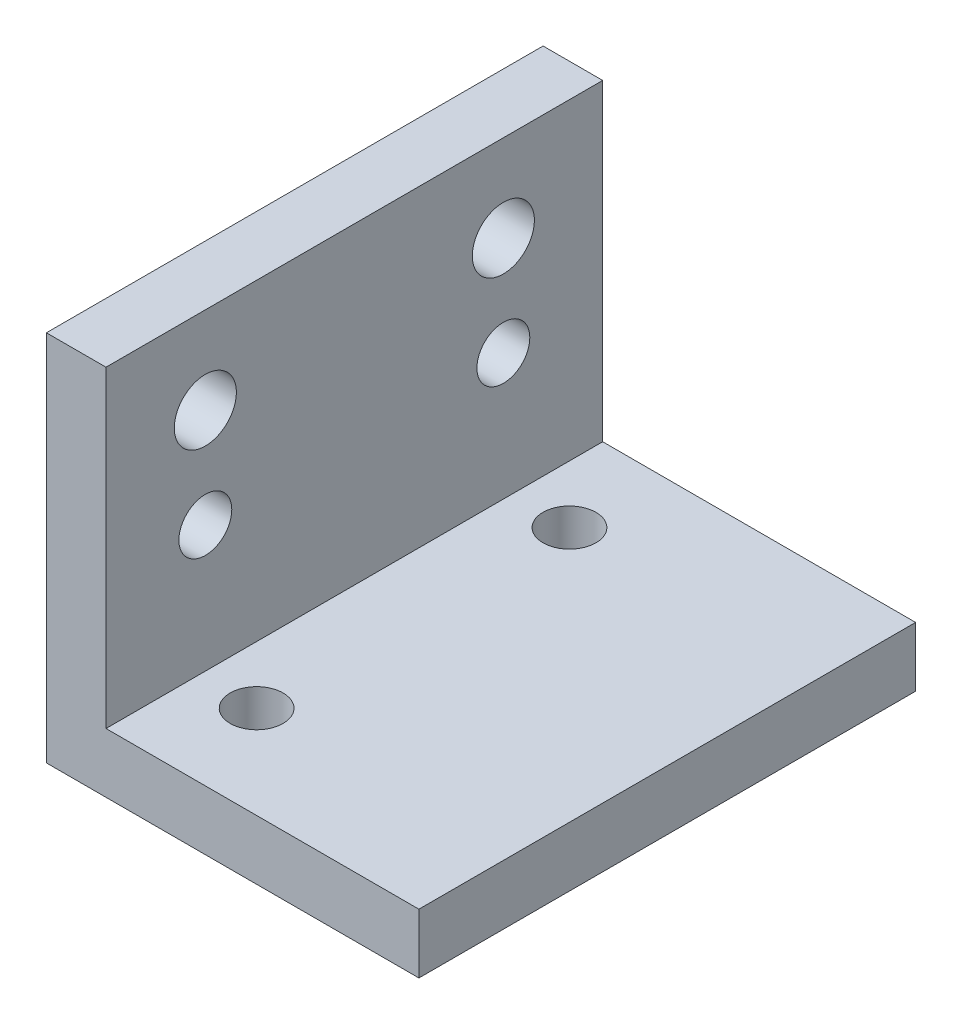
ISO-10303-21;
HEADER;
FILE_DESCRIPTION(('STEP AP214'),'2;1');
FILE_NAME('part.step','',(''),(''),'','','');
FILE_SCHEMA(('AUTOMOTIVE_DESIGN { 1 0 10303 214 1 1 1 1 }'));
ENDSEC;
DATA;
#1=APPLICATION_CONTEXT('core data for automotive mechanical design processes');
#2=APPLICATION_PROTOCOL_DEFINITION('international standard','automotive_design',2000,#1);
#3=PRODUCT_CONTEXT('',#1,'mechanical');
#4=PRODUCT('Part','Part','',(#3));
#5=PRODUCT_RELATED_PRODUCT_CATEGORY('part','',(#4));
#6=PRODUCT_DEFINITION_FORMATION('','',#4);
#7=PRODUCT_DEFINITION_CONTEXT('part definition',#1,'design');
#8=PRODUCT_DEFINITION('design','',#6,#7);
#9=PRODUCT_DEFINITION_SHAPE('','',#8);
#10=(LENGTH_UNIT() NAMED_UNIT(*) SI_UNIT(.MILLI.,.METRE.));
#11=(NAMED_UNIT(*) PLANE_ANGLE_UNIT() SI_UNIT($,.RADIAN.));
#12=(NAMED_UNIT(*) SI_UNIT($,.STERADIAN.) SOLID_ANGLE_UNIT());
#13=UNCERTAINTY_MEASURE_WITH_UNIT(LENGTH_MEASURE(1.E-05),#10,'distance_accuracy_value','');
#14=(GEOMETRIC_REPRESENTATION_CONTEXT(3) GLOBAL_UNCERTAINTY_ASSIGNED_CONTEXT((#13)) GLOBAL_UNIT_ASSIGNED_CONTEXT((#10,
#11,#12)) REPRESENTATION_CONTEXT('',''));
#15=CARTESIAN_POINT('',(0.,0.,0.));
#16=DIRECTION('',(0.,0.,1.));
#17=DIRECTION('',(1.,0.,0.));
#18=AXIS2_PLACEMENT_3D('',#15,#16,#17);
#19=CARTESIAN_POINT('',(0.,0.,25.4));
#20=DIRECTION('',(1.,0.,0.));
#21=DIRECTION('',(0.,0.,-1.));
#22=AXIS2_PLACEMENT_3D('',#19,#20,#21);
#23=PLANE('',#22);
#24=CARTESIAN_POINT('',(0.,14.605,5.07999999999999));
#25=DIRECTION('',(1.,0.,0.));
#26=DIRECTION('',(0.,1.,0.));
#27=AXIS2_PLACEMENT_3D('',#24,#25,#26);
#28=CIRCLE('',#27,1.5875);
#29=CARTESIAN_POINT('',(0.,16.1925,5.07999999999999));
#30=VERTEX_POINT('',#29);
#31=EDGE_CURVE('E178',#30,#30,#28,.T.);
#32=ORIENTED_EDGE('',*,*,#31,.T.);
#33=EDGE_LOOP('',(#32));
#34=FACE_BOUND('',#33,.T.);
#35=CARTESIAN_POINT('',(0.,14.605,20.32));
#36=DIRECTION('',(1.,0.,0.));
#37=DIRECTION('',(0.,1.,0.));
#38=AXIS2_PLACEMENT_3D('',#35,#36,#37);
#39=CIRCLE('',#38,1.5875);
#40=CARTESIAN_POINT('',(0.,16.1925,20.32));
#41=VERTEX_POINT('',#40);
#42=EDGE_CURVE('E182',#41,#41,#39,.T.);
#43=ORIENTED_EDGE('',*,*,#42,.T.);
#44=EDGE_LOOP('',(#43));
#45=FACE_BOUND('',#44,.T.);
#46=CARTESIAN_POINT('',(0.,9.525,20.32));
#47=DIRECTION('',(1.,0.,0.));
#48=DIRECTION('',(0.,0.,-1.));
#49=AXIS2_PLACEMENT_3D('',#46,#47,#48);
#50=CIRCLE('',#49,1.35255);
#51=CARTESIAN_POINT('',(0.,9.525,18.96745));
#52=VERTEX_POINT('',#51);
#53=EDGE_CURVE('E186',#52,#52,#50,.T.);
#54=ORIENTED_EDGE('',*,*,#53,.T.);
#55=EDGE_LOOP('',(#54));
#56=FACE_BOUND('',#55,.T.);
#57=CARTESIAN_POINT('',(0.,9.525,5.08));
#58=DIRECTION('',(1.,0.,0.));
#59=DIRECTION('',(0.,0.,-1.));
#60=AXIS2_PLACEMENT_3D('',#57,#58,#59);
#61=CIRCLE('',#60,1.35255);
#62=CARTESIAN_POINT('',(0.,9.525,3.72745));
#63=VERTEX_POINT('',#62);
#64=EDGE_CURVE('E135',#63,#63,#61,.T.);
#65=ORIENTED_EDGE('',*,*,#64,.T.);
#66=EDGE_LOOP('',(#65));
#67=FACE_BOUND('',#66,.T.);
#68=DIRECTION('',(0.,-1.,0.));
#69=VECTOR('',#68,1.);
#70=CARTESIAN_POINT('',(0.,0.,0.));
#71=LINE('',#70,#69);
#72=CARTESIAN_POINT('',(0.,19.05,0.));
#73=VERTEX_POINT('',#72);
#74=CARTESIAN_POINT('',(0.,0.,0.));
#75=VERTEX_POINT('',#74);
#76=EDGE_CURVE('E131',#73,#75,#71,.T.);
#77=ORIENTED_EDGE('',*,*,#76,.T.);
#78=DIRECTION('',(0.,0.,-1.));
#79=VECTOR('',#78,1.);
#80=CARTESIAN_POINT('',(0.,0.,25.4));
#81=LINE('',#80,#79);
#82=CARTESIAN_POINT('',(0.,0.,25.4));
#83=VERTEX_POINT('',#82);
#84=EDGE_CURVE('E13',#83,#75,#81,.T.);
#85=ORIENTED_EDGE('',*,*,#84,.F.);
#86=DIRECTION('',(0.,-1.,0.));
#87=VECTOR('',#86,1.);
#88=CARTESIAN_POINT('',(0.,0.,25.4));
#89=LINE('',#88,#87);
#90=CARTESIAN_POINT('',(0.,19.05,25.4));
#91=VERTEX_POINT('',#90);
#92=EDGE_CURVE('E142',#91,#83,#89,.T.);
#93=ORIENTED_EDGE('',*,*,#92,.F.);
#94=DIRECTION('',(0.,0.,-1.));
#95=VECTOR('',#94,1.);
#96=CARTESIAN_POINT('',(0.,19.05,25.4));
#97=LINE('',#96,#95);
#98=EDGE_CURVE('E127',#91,#73,#97,.T.);
#99=ORIENTED_EDGE('',*,*,#98,.T.);
#100=EDGE_LOOP('',(#77,#85,#93,#99));
#101=FACE_BOUND('',#100,.T.);
#102=ADVANCED_FACE('F47',(#34,#45,#56,#67,#101),#23,.F.);
#103=CARTESIAN_POINT('',(0.,0.,25.4));
#104=DIRECTION('',(0.,1.,0.));
#105=DIRECTION('',(0.,0.,1.));
#106=AXIS2_PLACEMENT_3D('',#103,#104,#105);
#107=PLANE('',#106);
#108=CARTESIAN_POINT('',(6.00000000000003,0.,20.65));
#109=DIRECTION('',(0.,1.,0.));
#110=DIRECTION('',(0.,0.,1.));
#111=AXIS2_PLACEMENT_3D('',#108,#109,#110);
#112=CIRCLE('',#111,1.35255);
#113=CARTESIAN_POINT('',(6.00000000000003,0.,22.00255));
#114=VERTEX_POINT('',#113);
#115=EDGE_CURVE('E207',#114,#114,#112,.T.);
#116=ORIENTED_EDGE('',*,*,#115,.T.);
#117=EDGE_LOOP('',(#116));
#118=FACE_BOUND('',#117,.T.);
#119=CARTESIAN_POINT('',(6.00000000000003,0.,4.65000000000003));
#120=DIRECTION('',(0.,1.,0.));
#121=DIRECTION('',(0.,0.,1.));
#122=AXIS2_PLACEMENT_3D('',#119,#120,#121);
#123=CIRCLE('',#122,1.35255);
#124=CARTESIAN_POINT('',(6.00000000000003,0.,6.00255000000003));
#125=VERTEX_POINT('',#124);
#126=EDGE_CURVE('E201',#125,#125,#123,.T.);
#127=ORIENTED_EDGE('',*,*,#126,.T.);
#128=EDGE_LOOP('',(#127));
#129=FACE_BOUND('',#128,.T.);
#130=DIRECTION('',(1.,0.,0.));
#131=VECTOR('',#130,1.);
#132=CARTESIAN_POINT('',(0.,0.,0.));
#133=LINE('',#132,#131);
#134=CARTESIAN_POINT('',(19.05,0.,0.));
#135=VERTEX_POINT('',#134);
#136=EDGE_CURVE('E134',#75,#135,#133,.T.);
#137=ORIENTED_EDGE('',*,*,#136,.T.);
#138=DIRECTION('',(0.,0.,-1.));
#139=VECTOR('',#138,1.);
#140=CARTESIAN_POINT('',(19.05,0.,25.4));
#141=LINE('',#140,#139);
#142=CARTESIAN_POINT('',(19.05,0.,25.4));
#143=VERTEX_POINT('',#142);
#144=EDGE_CURVE('E55',#143,#135,#141,.T.);
#145=ORIENTED_EDGE('',*,*,#144,.F.);
#146=DIRECTION('',(1.,0.,0.));
#147=VECTOR('',#146,1.);
#148=CARTESIAN_POINT('',(0.,0.,25.4));
#149=LINE('',#148,#147);
#150=EDGE_CURVE('E100',#83,#143,#149,.T.);
#151=ORIENTED_EDGE('',*,*,#150,.F.);
#152=ORIENTED_EDGE('',*,*,#84,.T.);
#153=EDGE_LOOP('',(#137,#145,#151,#152));
#154=FACE_BOUND('',#153,.T.);
#155=ADVANCED_FACE('F168',(#118,#129,#154),#107,.F.);
#156=CARTESIAN_POINT('',(19.05,0.,25.4));
#157=DIRECTION('',(-1.,0.,0.));
#158=DIRECTION('',(0.,-1.,0.));
#159=AXIS2_PLACEMENT_3D('',#156,#157,#158);
#160=PLANE('',#159);
#161=DIRECTION('',(0.,1.,0.));
#162=VECTOR('',#161,1.);
#163=CARTESIAN_POINT('',(19.05,0.,0.));
#164=LINE('',#163,#162);
#165=CARTESIAN_POINT('',(19.05,3.048,0.));
#166=VERTEX_POINT('',#165);
#167=EDGE_CURVE('E137',#135,#166,#164,.T.);
#168=ORIENTED_EDGE('',*,*,#167,.T.);
#169=DIRECTION('',(0.,0.,-1.));
#170=VECTOR('',#169,1.);
#171=CARTESIAN_POINT('',(19.05,3.048,25.4));
#172=LINE('',#171,#170);
#173=CARTESIAN_POINT('',(19.05,3.048,25.4));
#174=VERTEX_POINT('',#173);
#175=EDGE_CURVE('E122',#174,#166,#172,.T.);
#176=ORIENTED_EDGE('',*,*,#175,.F.);
#177=DIRECTION('',(0.,1.,0.));
#178=VECTOR('',#177,1.);
#179=CARTESIAN_POINT('',(19.05,0.,25.4));
#180=LINE('',#179,#178);
#181=EDGE_CURVE('E113',#143,#174,#180,.T.);
#182=ORIENTED_EDGE('',*,*,#181,.F.);
#183=ORIENTED_EDGE('',*,*,#144,.T.);
#184=EDGE_LOOP('',(#168,#176,#182,#183));
#185=FACE_BOUND('',#184,.T.);
#186=ADVANCED_FACE('F148',(#185),#160,.F.);
#187=CARTESIAN_POINT('',(19.05,3.048,25.4));
#188=DIRECTION('',(0.,-1.,0.));
#189=DIRECTION('',(1.,0.,0.));
#190=AXIS2_PLACEMENT_3D('',#187,#188,#189);
#191=PLANE('',#190);
#192=CARTESIAN_POINT('',(6.00000000000003,3.048,20.65));
#193=DIRECTION('',(0.,1.,0.));
#194=DIRECTION('',(0.,0.,1.));
#195=AXIS2_PLACEMENT_3D('',#192,#193,#194);
#196=CIRCLE('',#195,1.35254999999999);
#197=CARTESIAN_POINT('',(6.00000000000003,3.048,22.00255));
#198=VERTEX_POINT('',#197);
#199=EDGE_CURVE('E210',#198,#198,#196,.T.);
#200=ORIENTED_EDGE('',*,*,#199,.F.);
#201=EDGE_LOOP('',(#200));
#202=FACE_BOUND('',#201,.T.);
#203=CARTESIAN_POINT('',(6.00000000000003,3.048,4.65000000000003));
#204=DIRECTION('',(0.,1.,0.));
#205=DIRECTION('',(0.,0.,1.));
#206=AXIS2_PLACEMENT_3D('',#203,#204,#205);
#207=CIRCLE('',#206,1.35254999999999);
#208=CARTESIAN_POINT('',(6.00000000000003,3.048,6.00255000000002));
#209=VERTEX_POINT('',#208);
#210=EDGE_CURVE('E204',#209,#209,#207,.T.);
#211=ORIENTED_EDGE('',*,*,#210,.F.);
#212=EDGE_LOOP('',(#211));
#213=FACE_BOUND('',#212,.T.);
#214=DIRECTION('',(-1.,0.,0.));
#215=VECTOR('',#214,1.);
#216=CARTESIAN_POINT('',(19.05,3.048,0.));
#217=LINE('',#216,#215);
#218=CARTESIAN_POINT('',(3.048,3.048,0.));
#219=VERTEX_POINT('',#218);
#220=EDGE_CURVE('E121',#166,#219,#217,.T.);
#221=ORIENTED_EDGE('',*,*,#220,.T.);
#222=DIRECTION('',(0.,0.,-1.));
#223=VECTOR('',#222,1.);
#224=CARTESIAN_POINT('',(3.048,3.048,25.4));
#225=LINE('',#224,#223);
#226=CARTESIAN_POINT('',(3.048,3.048,25.4));
#227=VERTEX_POINT('',#226);
#228=EDGE_CURVE('E118',#227,#219,#225,.T.);
#229=ORIENTED_EDGE('',*,*,#228,.F.);
#230=DIRECTION('',(-1.,0.,0.));
#231=VECTOR('',#230,1.);
#232=CARTESIAN_POINT('',(19.05,3.048,25.4));
#233=LINE('',#232,#231);
#234=EDGE_CURVE('E107',#174,#227,#233,.T.);
#235=ORIENTED_EDGE('',*,*,#234,.F.);
#236=ORIENTED_EDGE('',*,*,#175,.T.);
#237=EDGE_LOOP('',(#221,#229,#235,#236));
#238=FACE_BOUND('',#237,.T.);
#239=ADVANCED_FACE('F119',(#202,#213,#238),#191,.F.);
#240=CARTESIAN_POINT('',(3.048,19.05,25.4));
#241=DIRECTION('',(-1.,0.,0.));
#242=DIRECTION('',(0.,-1.,0.));
#243=AXIS2_PLACEMENT_3D('',#240,#241,#242);
#244=PLANE('',#243);
#245=CARTESIAN_POINT('',(3.048,14.605,5.07999999999999));
#246=DIRECTION('',(1.,0.,0.));
#247=DIRECTION('',(0.,1.,0.));
#248=AXIS2_PLACEMENT_3D('',#245,#246,#247);
#249=CIRCLE('',#248,1.5875);
#250=CARTESIAN_POINT('',(3.048,16.1925,5.07999999999999));
#251=VERTEX_POINT('',#250);
#252=EDGE_CURVE('E217',#251,#251,#249,.T.);
#253=ORIENTED_EDGE('',*,*,#252,.F.);
#254=EDGE_LOOP('',(#253));
#255=FACE_BOUND('',#254,.T.);
#256=CARTESIAN_POINT('',(3.048,14.605,20.32));
#257=DIRECTION('',(1.,0.,0.));
#258=DIRECTION('',(0.,1.,0.));
#259=AXIS2_PLACEMENT_3D('',#256,#257,#258);
#260=CIRCLE('',#259,1.5875);
#261=CARTESIAN_POINT('',(3.048,16.1925,20.32));
#262=VERTEX_POINT('',#261);
#263=EDGE_CURVE('E213',#262,#262,#260,.T.);
#264=ORIENTED_EDGE('',*,*,#263,.F.);
#265=EDGE_LOOP('',(#264));
#266=FACE_BOUND('',#265,.T.);
#267=CARTESIAN_POINT('',(3.048,9.525,20.32));
#268=DIRECTION('',(1.,0.,0.));
#269=DIRECTION('',(0.,0.,-1.));
#270=AXIS2_PLACEMENT_3D('',#267,#268,#269);
#271=CIRCLE('',#270,1.35254999999999);
#272=CARTESIAN_POINT('',(3.048,9.525,18.96745));
#273=VERTEX_POINT('',#272);
#274=EDGE_CURVE('E198',#273,#273,#271,.T.);
#275=ORIENTED_EDGE('',*,*,#274,.F.);
#276=EDGE_LOOP('',(#275));
#277=FACE_BOUND('',#276,.T.);
#278=CARTESIAN_POINT('',(3.048,9.525,5.08));
#279=DIRECTION('',(1.,0.,0.));
#280=DIRECTION('',(0.,0.,-1.));
#281=AXIS2_PLACEMENT_3D('',#278,#279,#280);
#282=CIRCLE('',#281,1.35254999999999);
#283=CARTESIAN_POINT('',(3.048,9.525,3.72745000000001));
#284=VERTEX_POINT('',#283);
#285=EDGE_CURVE('E190',#284,#284,#282,.T.);
#286=ORIENTED_EDGE('',*,*,#285,.F.);
#287=EDGE_LOOP('',(#286));
#288=FACE_BOUND('',#287,.T.);
#289=DIRECTION('',(0.,1.,0.));
#290=VECTOR('',#289,1.);
#291=CARTESIAN_POINT('',(3.048,19.05,0.));
#292=LINE('',#291,#290);
#293=CARTESIAN_POINT('',(3.048,19.05,0.));
#294=VERTEX_POINT('',#293);
#295=EDGE_CURVE('E86',#219,#294,#292,.T.);
#296=ORIENTED_EDGE('',*,*,#295,.T.);
#297=DIRECTION('',(0.,0.,-1.));
#298=VECTOR('',#297,1.);
#299=CARTESIAN_POINT('',(3.048,19.05,25.4));
#300=LINE('',#299,#298);
#301=CARTESIAN_POINT('',(3.048,19.05,25.4));
#302=VERTEX_POINT('',#301);
#303=EDGE_CURVE('E123',#302,#294,#300,.T.);
#304=ORIENTED_EDGE('',*,*,#303,.F.);
#305=DIRECTION('',(0.,1.,0.));
#306=VECTOR('',#305,1.);
#307=CARTESIAN_POINT('',(3.048,19.05,25.4));
#308=LINE('',#307,#306);
#309=EDGE_CURVE('E111',#227,#302,#308,.T.);
#310=ORIENTED_EDGE('',*,*,#309,.F.);
#311=ORIENTED_EDGE('',*,*,#228,.T.);
#312=EDGE_LOOP('',(#296,#304,#310,#311));
#313=FACE_BOUND('',#312,.T.);
#314=ADVANCED_FACE('F125',(#255,#266,#277,#288,#313),#244,.F.);
#315=CARTESIAN_POINT('',(0.,19.05,25.4));
#316=DIRECTION('',(0.,-1.,0.));
#317=DIRECTION('',(1.,0.,0.));
#318=AXIS2_PLACEMENT_3D('',#315,#316,#317);
#319=PLANE('',#318);
#320=DIRECTION('',(-1.,0.,0.));
#321=VECTOR('',#320,1.);
#322=CARTESIAN_POINT('',(0.,19.05,0.));
#323=LINE('',#322,#321);
#324=EDGE_CURVE('E92',#294,#73,#323,.T.);
#325=ORIENTED_EDGE('',*,*,#324,.T.);
#326=ORIENTED_EDGE('',*,*,#98,.F.);
#327=DIRECTION('',(-1.,0.,0.));
#328=VECTOR('',#327,1.);
#329=CARTESIAN_POINT('',(0.,19.05,25.4));
#330=LINE('',#329,#328);
#331=EDGE_CURVE('E63',#302,#91,#330,.T.);
#332=ORIENTED_EDGE('',*,*,#331,.F.);
#333=ORIENTED_EDGE('',*,*,#303,.T.);
#334=EDGE_LOOP('',(#325,#326,#332,#333));
#335=FACE_BOUND('',#334,.T.);
#336=ADVANCED_FACE('F155',(#335),#319,.F.);
#337=CARTESIAN_POINT('',(0.,0.,25.4));
#338=DIRECTION('',(0.,0.,-1.));
#339=DIRECTION('',(-1.,0.,0.));
#340=AXIS2_PLACEMENT_3D('',#337,#338,#339);
#341=PLANE('',#340);
#342=ORIENTED_EDGE('',*,*,#92,.T.);
#343=ORIENTED_EDGE('',*,*,#150,.T.);
#344=ORIENTED_EDGE('',*,*,#181,.T.);
#345=ORIENTED_EDGE('',*,*,#234,.T.);
#346=ORIENTED_EDGE('',*,*,#309,.T.);
#347=ORIENTED_EDGE('',*,*,#331,.T.);
#348=EDGE_LOOP('',(#342,#343,#344,#345,#346,#347));
#349=FACE_BOUND('',#348,.T.);
#350=ADVANCED_FACE('F109',(#349),#341,.F.);
#351=CARTESIAN_POINT('',(0.,0.,0.));
#352=DIRECTION('',(0.,0.,-1.));
#353=DIRECTION('',(-1.,0.,0.));
#354=AXIS2_PLACEMENT_3D('',#351,#352,#353);
#355=PLANE('',#354);
#356=ORIENTED_EDGE('',*,*,#76,.F.);
#357=ORIENTED_EDGE('',*,*,#324,.F.);
#358=ORIENTED_EDGE('',*,*,#295,.F.);
#359=ORIENTED_EDGE('',*,*,#220,.F.);
#360=ORIENTED_EDGE('',*,*,#167,.F.);
#361=ORIENTED_EDGE('',*,*,#136,.F.);
#362=EDGE_LOOP('',(#356,#357,#358,#359,#360,#361));
#363=FACE_BOUND('',#362,.T.);
#364=ADVANCED_FACE('F151',(#363),#355,.T.);
#365=CARTESIAN_POINT('',(3.048,9.525,5.08));
#366=DIRECTION('',(1.,0.,0.));
#367=DIRECTION('',(0.,0.,-1.));
#368=AXIS2_PLACEMENT_3D('',#365,#366,#367);
#369=CYLINDRICAL_SURFACE('',#368,1.35254999999999);
#370=ORIENTED_EDGE('',*,*,#64,.F.);
#371=EDGE_LOOP('',(#370));
#372=FACE_BOUND('',#371,.T.);
#373=ORIENTED_EDGE('',*,*,#285,.T.);
#374=EDGE_LOOP('',(#373));
#375=FACE_BOUND('',#374,.T.);
#376=ADVANCED_FACE('F230',(#372,#375),#369,.F.);
#377=CARTESIAN_POINT('',(3.048,9.525,20.32));
#378=DIRECTION('',(1.,0.,0.));
#379=DIRECTION('',(0.,0.,-1.));
#380=AXIS2_PLACEMENT_3D('',#377,#378,#379);
#381=CYLINDRICAL_SURFACE('',#380,1.35254999999999);
#382=ORIENTED_EDGE('',*,*,#53,.F.);
#383=EDGE_LOOP('',(#382));
#384=FACE_BOUND('',#383,.T.);
#385=ORIENTED_EDGE('',*,*,#274,.T.);
#386=EDGE_LOOP('',(#385));
#387=FACE_BOUND('',#386,.T.);
#388=ADVANCED_FACE('F232',(#384,#387),#381,.F.);
#389=CARTESIAN_POINT('',(6.00000000000003,3.048,4.65000000000003));
#390=DIRECTION('',(0.,1.,0.));
#391=DIRECTION('',(0.,0.,1.));
#392=AXIS2_PLACEMENT_3D('',#389,#390,#391);
#393=CYLINDRICAL_SURFACE('',#392,1.35254999999999);
#394=ORIENTED_EDGE('',*,*,#126,.F.);
#395=EDGE_LOOP('',(#394));
#396=FACE_BOUND('',#395,.T.);
#397=ORIENTED_EDGE('',*,*,#210,.T.);
#398=EDGE_LOOP('',(#397));
#399=FACE_BOUND('',#398,.T.);
#400=ADVANCED_FACE('F238',(#396,#399),#393,.F.);
#401=CARTESIAN_POINT('',(6.00000000000003,3.048,20.65));
#402=DIRECTION('',(0.,1.,0.));
#403=DIRECTION('',(0.,0.,1.));
#404=AXIS2_PLACEMENT_3D('',#401,#402,#403);
#405=CYLINDRICAL_SURFACE('',#404,1.35254999999999);
#406=ORIENTED_EDGE('',*,*,#115,.F.);
#407=EDGE_LOOP('',(#406));
#408=FACE_BOUND('',#407,.T.);
#409=ORIENTED_EDGE('',*,*,#199,.T.);
#410=EDGE_LOOP('',(#409));
#411=FACE_BOUND('',#410,.T.);
#412=ADVANCED_FACE('F244',(#408,#411),#405,.F.);
#413=CARTESIAN_POINT('',(0.,14.605,20.32));
#414=DIRECTION('',(1.,0.,0.));
#415=DIRECTION('',(0.,1.,0.));
#416=AXIS2_PLACEMENT_3D('',#413,#414,#415);
#417=CYLINDRICAL_SURFACE('',#416,1.5875);
#418=ORIENTED_EDGE('',*,*,#42,.F.);
#419=EDGE_LOOP('',(#418));
#420=FACE_BOUND('',#419,.T.);
#421=ORIENTED_EDGE('',*,*,#263,.T.);
#422=EDGE_LOOP('',(#421));
#423=FACE_BOUND('',#422,.T.);
#424=ADVANCED_FACE('F248',(#420,#423),#417,.F.);
#425=CARTESIAN_POINT('',(0.,14.605,5.07999999999999));
#426=DIRECTION('',(1.,0.,0.));
#427=DIRECTION('',(0.,1.,0.));
#428=AXIS2_PLACEMENT_3D('',#425,#426,#427);
#429=CYLINDRICAL_SURFACE('',#428,1.5875);
#430=ORIENTED_EDGE('',*,*,#31,.F.);
#431=EDGE_LOOP('',(#430));
#432=FACE_BOUND('',#431,.T.);
#433=ORIENTED_EDGE('',*,*,#252,.T.);
#434=EDGE_LOOP('',(#433));
#435=FACE_BOUND('',#434,.T.);
#436=ADVANCED_FACE('F222',(#432,#435),#429,.F.);
#437=CLOSED_SHELL('',(#102,#155,#186,#239,#314,#336,#350,#364,#376,#388,#400,#412,#424,#436));
#438=MANIFOLD_SOLID_BREP('B2',#437);
#439=ADVANCED_BREP_SHAPE_REPRESENTATION('',(#18,#438),#14);
#440=SHAPE_DEFINITION_REPRESENTATION(#9,#439);
ENDSEC;
END-ISO-10303-21;
